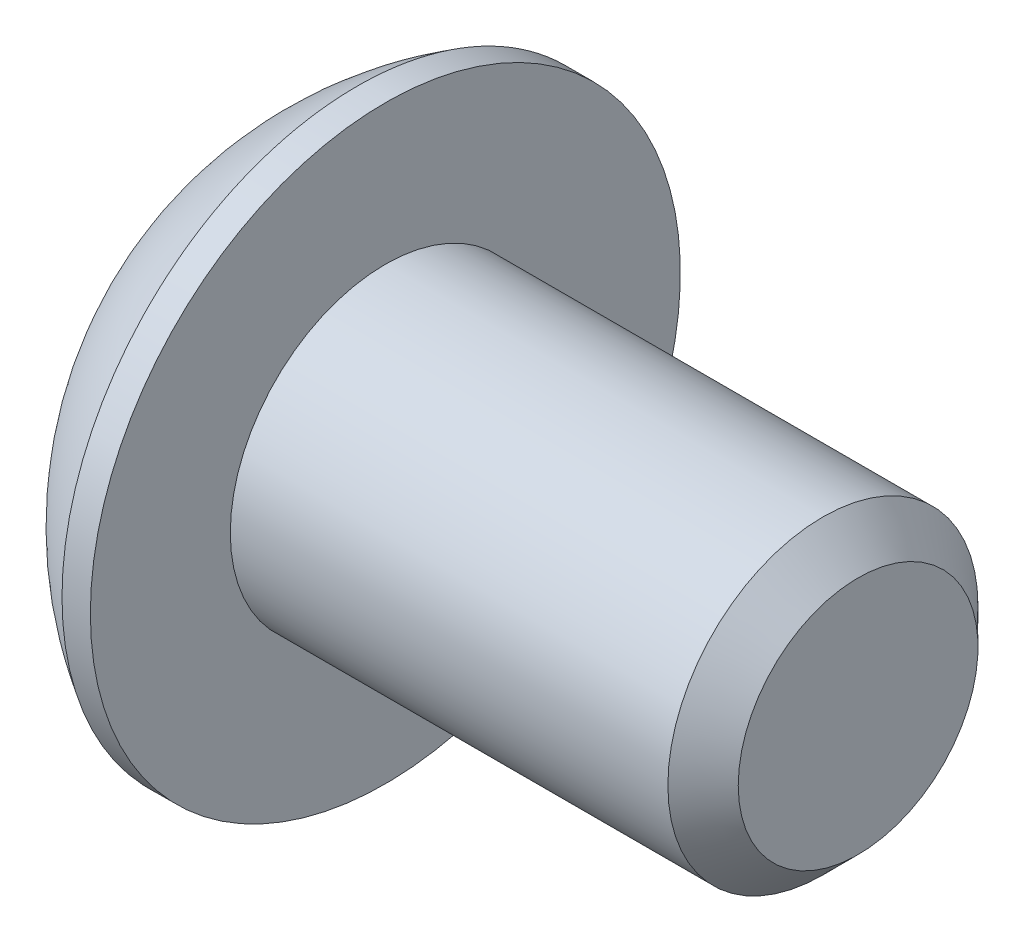
ISO-10303-21;
HEADER;
FILE_DESCRIPTION(('STEP AP214'),'2;1');
FILE_NAME('part.step','',(''),(''),'','','');
FILE_SCHEMA(('AUTOMOTIVE_DESIGN { 1 0 10303 214 1 1 1 1 }'));
ENDSEC;
DATA;
#1=APPLICATION_CONTEXT('core data for automotive mechanical design processes');
#2=APPLICATION_PROTOCOL_DEFINITION('international standard','automotive_design',2000,#1);
#3=PRODUCT_CONTEXT('',#1,'mechanical');
#4=PRODUCT('Part','Part','',(#3));
#5=PRODUCT_RELATED_PRODUCT_CATEGORY('part','',(#4));
#6=PRODUCT_DEFINITION_FORMATION('','',#4);
#7=PRODUCT_DEFINITION_CONTEXT('part definition',#1,'design');
#8=PRODUCT_DEFINITION('design','',#6,#7);
#9=PRODUCT_DEFINITION_SHAPE('','',#8);
#10=(LENGTH_UNIT() NAMED_UNIT(*) SI_UNIT(.MILLI.,.METRE.));
#11=(NAMED_UNIT(*) PLANE_ANGLE_UNIT() SI_UNIT($,.RADIAN.));
#12=(NAMED_UNIT(*) SI_UNIT($,.STERADIAN.) SOLID_ANGLE_UNIT());
#13=UNCERTAINTY_MEASURE_WITH_UNIT(LENGTH_MEASURE(1.E-05),#10,'distance_accuracy_value','');
#14=(GEOMETRIC_REPRESENTATION_CONTEXT(3) GLOBAL_UNCERTAINTY_ASSIGNED_CONTEXT((#13)) GLOBAL_UNIT_ASSIGNED_CONTEXT((#10,
#11,#12)) REPRESENTATION_CONTEXT('',''));
#15=CARTESIAN_POINT('',(0.,0.,0.));
#16=DIRECTION('',(0.,0.,1.));
#17=DIRECTION('',(1.,0.,0.));
#18=AXIS2_PLACEMENT_3D('',#15,#16,#17);
#19=CARTESIAN_POINT('',(1.32080000000034,0.,0.));
#20=DIRECTION('',(-1.,0.,0.));
#21=DIRECTION('',(0.,0.,1.));
#22=AXIS2_PLACEMENT_3D('',#19,#20,#21);
#23=CONICAL_SURFACE('',#22,1.1937999999998,1.04719755119608);
#24=CARTESIAN_POINT('',(2.01004075135902,0.,4.44089209850063E-13));
#25=VERTEX_POINT('',#24);
#26=VERTEX_LOOP('',#25);
#27=FACE_BOUND('',#26,.T.);
#28=CARTESIAN_POINT('',(1.32080000000009,0.,0.));
#29=DIRECTION('',(-1.,0.,0.));
#30=DIRECTION('',(0.,0.,1.));
#31=AXIS2_PLACEMENT_3D('',#28,#29,#30);
#32=CIRCLE('',#31,1.19380000000024);
#33=CARTESIAN_POINT('',(1.32080000000004,-1.03386112703797,0.59690000000006));
#34=VERTEX_POINT('',#33);
#35=CARTESIAN_POINT('',(1.32080000000004,0.,1.19380000000012));
#36=VERTEX_POINT('',#35);
#37=EDGE_CURVE('E18',#34,#36,#32,.T.);
#38=ORIENTED_EDGE('',*,*,#37,.T.);
#39=CARTESIAN_POINT('',(1.32080000000009,0.,0.));
#40=DIRECTION('',(-1.,0.,0.));
#41=DIRECTION('',(0.,0.,1.));
#42=AXIS2_PLACEMENT_3D('',#39,#40,#41);
#43=CIRCLE('',#42,1.19380000000024);
#44=CARTESIAN_POINT('',(1.32080000000004,1.03386112703797,0.596900000000061));
#45=VERTEX_POINT('',#44);
#46=EDGE_CURVE('E147',#36,#45,#43,.T.);
#47=ORIENTED_EDGE('',*,*,#46,.T.);
#48=CARTESIAN_POINT('',(1.32080000000009,0.,0.));
#49=DIRECTION('',(-1.,0.,0.));
#50=DIRECTION('',(0.,0.,1.));
#51=AXIS2_PLACEMENT_3D('',#48,#49,#50);
#52=CIRCLE('',#51,1.19380000000024);
#53=CARTESIAN_POINT('',(1.32080000000004,1.03386112703797,-0.596900000000061));
#54=VERTEX_POINT('',#53);
#55=EDGE_CURVE('E475',#45,#54,#52,.T.);
#56=ORIENTED_EDGE('',*,*,#55,.T.);
#57=CARTESIAN_POINT('',(1.32080000000009,0.,0.));
#58=DIRECTION('',(-1.,0.,0.));
#59=DIRECTION('',(0.,0.,1.));
#60=AXIS2_PLACEMENT_3D('',#57,#58,#59);
#61=CIRCLE('',#60,1.19380000000024);
#62=CARTESIAN_POINT('',(1.32080000000004,1.49457637585666E-12,-1.19380000000012));
#63=VERTEX_POINT('',#62);
#64=EDGE_CURVE('E476',#54,#63,#61,.T.);
#65=ORIENTED_EDGE('',*,*,#64,.T.);
#66=CARTESIAN_POINT('',(1.32080000000009,0.,0.));
#67=DIRECTION('',(-1.,0.,0.));
#68=DIRECTION('',(0.,0.,1.));
#69=AXIS2_PLACEMENT_3D('',#66,#67,#68);
#70=CIRCLE('',#69,1.19380000000024);
#71=CARTESIAN_POINT('',(1.32080000000004,-1.03386112703797,-0.59690000000006));
#72=VERTEX_POINT('',#71);
#73=EDGE_CURVE('E91',#63,#72,#70,.T.);
#74=ORIENTED_EDGE('',*,*,#73,.T.);
#75=CARTESIAN_POINT('',(1.32080000000009,0.,0.));
#76=DIRECTION('',(-1.,0.,0.));
#77=DIRECTION('',(0.,0.,1.));
#78=AXIS2_PLACEMENT_3D('',#75,#76,#77);
#79=CIRCLE('',#78,1.19380000000024);
#80=EDGE_CURVE('E87',#72,#34,#79,.T.);
#81=ORIENTED_EDGE('',*,*,#80,.T.);
#82=EDGE_LOOP('',(#38,#47,#56,#65,#74,#81));
#83=FACE_BOUND('',#82,.T.);
#84=ADVANCED_FACE('F15',(#27,#83),#23,.F.);
#85=CARTESIAN_POINT('',(1.3208,-2.06772225407572,-1.1938));
#86=DIRECTION('',(1.,0.,0.));
#87=DIRECTION('',(0.,0.,-1.));
#88=AXIS2_PLACEMENT_3D('',#85,#86,#87);
#89=PLANE('',#88);
#90=DIRECTION('',(0.,0.5,0.866025403784439));
#91=VECTOR('',#90,1.);
#92=CARTESIAN_POINT('',(1.3208,-1.37848150271715,0.));
#93=LINE('',#92,#91);
#94=CARTESIAN_POINT('',(1.3208,-0.689240751358574,1.1938));
#95=VERTEX_POINT('',#94);
#96=EDGE_CURVE('E99',#95,#34,#93,.F.);
#97=ORIENTED_EDGE('',*,*,#96,.F.);
#98=DIRECTION('',(0.,1.,0.));
#99=VECTOR('',#98,1.);
#100=CARTESIAN_POINT('',(1.3208,-0.689240751358574,1.1938));
#101=LINE('',#100,#99);
#102=EDGE_CURVE('E101',#36,#95,#101,.F.);
#103=ORIENTED_EDGE('',*,*,#102,.F.);
#104=ORIENTED_EDGE('',*,*,#37,.F.);
#105=EDGE_LOOP('',(#97,#103,#104));
#106=FACE_BOUND('',#105,.T.);
#107=ADVANCED_FACE('F97',(#106),#89,.F.);
#108=CARTESIAN_POINT('',(1.3208,-2.06772225407572,-1.1938));
#109=DIRECTION('',(1.,0.,0.));
#110=DIRECTION('',(0.,0.,-1.));
#111=AXIS2_PLACEMENT_3D('',#108,#109,#110);
#112=PLANE('',#111);
#113=DIRECTION('',(0.,-0.5,0.866025403784439));
#114=VECTOR('',#113,1.);
#115=CARTESIAN_POINT('',(1.3208,-0.689240751358574,-1.1938));
#116=LINE('',#115,#114);
#117=CARTESIAN_POINT('',(1.3208,-1.37848150271715,0.));
#118=VERTEX_POINT('',#117);
#119=EDGE_CURVE('E107',#118,#72,#116,.F.);
#120=ORIENTED_EDGE('',*,*,#119,.F.);
#121=DIRECTION('',(0.,0.5,0.866025403784439));
#122=VECTOR('',#121,1.);
#123=CARTESIAN_POINT('',(1.3208,-1.37848150271715,0.));
#124=LINE('',#123,#122);
#125=EDGE_CURVE('E104',#34,#118,#124,.F.);
#126=ORIENTED_EDGE('',*,*,#125,.F.);
#127=ORIENTED_EDGE('',*,*,#80,.F.);
#128=EDGE_LOOP('',(#120,#126,#127));
#129=FACE_BOUND('',#128,.T.);
#130=ADVANCED_FACE('F105',(#129),#112,.F.);
#131=CARTESIAN_POINT('',(1.3208,-2.06772225407572,-1.1938));
#132=DIRECTION('',(1.,0.,0.));
#133=DIRECTION('',(0.,0.,-1.));
#134=AXIS2_PLACEMENT_3D('',#131,#132,#133);
#135=PLANE('',#134);
#136=DIRECTION('',(0.,1.,0.));
#137=VECTOR('',#136,1.);
#138=CARTESIAN_POINT('',(1.3208,0.689240751358577,-1.1938));
#139=LINE('',#138,#137);
#140=CARTESIAN_POINT('',(1.3208,-0.689240751358574,-1.1938));
#141=VERTEX_POINT('',#140);
#142=EDGE_CURVE('E446',#141,#63,#139,.T.);
#143=ORIENTED_EDGE('',*,*,#142,.F.);
#144=DIRECTION('',(0.,-0.5,0.866025403784439));
#145=VECTOR('',#144,1.);
#146=CARTESIAN_POINT('',(1.3208,-0.689240751358574,-1.1938));
#147=LINE('',#146,#145);
#148=EDGE_CURVE('E458',#72,#141,#147,.F.);
#149=ORIENTED_EDGE('',*,*,#148,.F.);
#150=ORIENTED_EDGE('',*,*,#73,.F.);
#151=EDGE_LOOP('',(#143,#149,#150));
#152=FACE_BOUND('',#151,.T.);
#153=ADVANCED_FACE('F190',(#152),#135,.F.);
#154=CARTESIAN_POINT('',(1.3208,-2.06772225407572,-1.1938));
#155=DIRECTION('',(1.,0.,0.));
#156=DIRECTION('',(0.,0.,-1.));
#157=AXIS2_PLACEMENT_3D('',#154,#155,#156);
#158=PLANE('',#157);
#159=DIRECTION('',(0.,-0.5,-0.866025403784439));
#160=VECTOR('',#159,1.);
#161=CARTESIAN_POINT('',(1.3208,1.37848150271715,0.));
#162=LINE('',#161,#160);
#163=CARTESIAN_POINT('',(1.3208,0.689240751358577,-1.1938));
#164=VERTEX_POINT('',#163);
#165=EDGE_CURVE('E432',#164,#54,#162,.F.);
#166=ORIENTED_EDGE('',*,*,#165,.F.);
#167=DIRECTION('',(0.,1.,0.));
#168=VECTOR('',#167,1.);
#169=CARTESIAN_POINT('',(1.3208,0.689240751358577,-1.1938));
#170=LINE('',#169,#168);
#171=EDGE_CURVE('E443',#63,#164,#170,.T.);
#172=ORIENTED_EDGE('',*,*,#171,.F.);
#173=ORIENTED_EDGE('',*,*,#64,.F.);
#174=EDGE_LOOP('',(#166,#172,#173));
#175=FACE_BOUND('',#174,.T.);
#176=ADVANCED_FACE('F186',(#175),#158,.F.);
#177=CARTESIAN_POINT('',(1.3208,-2.06772225407572,-1.1938));
#178=DIRECTION('',(1.,0.,0.));
#179=DIRECTION('',(0.,0.,-1.));
#180=AXIS2_PLACEMENT_3D('',#177,#178,#179);
#181=PLANE('',#180);
#182=DIRECTION('',(0.,0.5,-0.866025403784439));
#183=VECTOR('',#182,1.);
#184=CARTESIAN_POINT('',(1.3208,0.689240751358576,1.1938));
#185=LINE('',#184,#183);
#186=CARTESIAN_POINT('',(1.3208,1.37848150271715,0.));
#187=VERTEX_POINT('',#186);
#188=EDGE_CURVE('E411',#187,#45,#185,.F.);
#189=ORIENTED_EDGE('',*,*,#188,.F.);
#190=DIRECTION('',(0.,-0.5,-0.866025403784439));
#191=VECTOR('',#190,1.);
#192=CARTESIAN_POINT('',(1.3208,1.37848150271715,0.));
#193=LINE('',#192,#191);
#194=EDGE_CURVE('E430',#54,#187,#193,.F.);
#195=ORIENTED_EDGE('',*,*,#194,.F.);
#196=ORIENTED_EDGE('',*,*,#55,.F.);
#197=EDGE_LOOP('',(#189,#195,#196));
#198=FACE_BOUND('',#197,.T.);
#199=ADVANCED_FACE('F182',(#198),#181,.F.);
#200=CARTESIAN_POINT('',(1.3208,-2.06772225407572,-1.1938));
#201=DIRECTION('',(1.,0.,0.));
#202=DIRECTION('',(0.,0.,-1.));
#203=AXIS2_PLACEMENT_3D('',#200,#201,#202);
#204=PLANE('',#203);
#205=DIRECTION('',(0.,1.,0.));
#206=VECTOR('',#205,1.);
#207=CARTESIAN_POINT('',(1.3208,-0.689240751358574,1.1938));
#208=LINE('',#207,#206);
#209=CARTESIAN_POINT('',(1.3208,0.689240751358576,1.1938));
#210=VERTEX_POINT('',#209);
#211=EDGE_CURVE('E116',#210,#36,#208,.F.);
#212=ORIENTED_EDGE('',*,*,#211,.F.);
#213=DIRECTION('',(0.,0.5,-0.866025403784439));
#214=VECTOR('',#213,1.);
#215=CARTESIAN_POINT('',(1.3208,0.689240751358576,1.1938));
#216=LINE('',#215,#214);
#217=EDGE_CURVE('E414',#45,#210,#216,.F.);
#218=ORIENTED_EDGE('',*,*,#217,.F.);
#219=ORIENTED_EDGE('',*,*,#46,.F.);
#220=EDGE_LOOP('',(#212,#218,#219));
#221=FACE_BOUND('',#220,.T.);
#222=ADVANCED_FACE('F178',(#221),#204,.F.);
#223=CARTESIAN_POINT('',(1.3208,-0.689240751358574,1.1938));
#224=DIRECTION('',(0.,0.,-1.));
#225=DIRECTION('',(0.,1.,0.));
#226=AXIS2_PLACEMENT_3D('',#223,#224,#225);
#227=PLANE('',#226);
#228=DIRECTION('',(0.,1.,0.));
#229=VECTOR('',#228,1.);
#230=CARTESIAN_POINT('',(0.,0.,1.1938));
#231=LINE('',#230,#229);
#232=CARTESIAN_POINT('',(0.,0.689240751358577,1.1938));
#233=VERTEX_POINT('',#232);
#234=CARTESIAN_POINT('',(0.,-0.689240751358574,1.1938));
#235=VERTEX_POINT('',#234);
#236=EDGE_CURVE('E408',#233,#235,#231,.F.);
#237=ORIENTED_EDGE('',*,*,#236,.F.);
#238=DIRECTION('',(1.,0.,0.));
#239=VECTOR('',#238,1.);
#240=CARTESIAN_POINT('',(1.3208,0.689240751358576,1.1938));
#241=LINE('',#240,#239);
#242=EDGE_CURVE('E420',#210,#233,#241,.F.);
#243=ORIENTED_EDGE('',*,*,#242,.F.);
#244=ORIENTED_EDGE('',*,*,#211,.T.);
#245=ORIENTED_EDGE('',*,*,#102,.T.);
#246=DIRECTION('',(1.,0.,0.));
#247=VECTOR('',#246,1.);
#248=CARTESIAN_POINT('',(1.3208,-0.689240751358574,1.1938));
#249=LINE('',#248,#247);
#250=EDGE_CURVE('E110',#235,#95,#249,.T.);
#251=ORIENTED_EDGE('',*,*,#250,.F.);
#252=EDGE_LOOP('',(#237,#243,#244,#245,#251));
#253=FACE_BOUND('',#252,.T.);
#254=ADVANCED_FACE('F175',(#253),#227,.T.);
#255=CARTESIAN_POINT('',(1.3208,-1.37848150271715,0.));
#256=DIRECTION('',(0.,0.866025403784439,-0.5));
#257=DIRECTION('',(0.,0.5,0.866025403784439));
#258=AXIS2_PLACEMENT_3D('',#255,#256,#257);
#259=PLANE('',#258);
#260=DIRECTION('',(0.,-0.5,-0.866025403784439));
#261=VECTOR('',#260,1.);
#262=CARTESIAN_POINT('',(0.,-0.689240751358574,1.1938));
#263=LINE('',#262,#261);
#264=CARTESIAN_POINT('',(0.,-1.37848150271715,0.));
#265=VERTEX_POINT('',#264);
#266=EDGE_CURVE('E405',#235,#265,#263,.T.);
#267=ORIENTED_EDGE('',*,*,#266,.F.);
#268=ORIENTED_EDGE('',*,*,#250,.T.);
#269=ORIENTED_EDGE('',*,*,#96,.T.);
#270=ORIENTED_EDGE('',*,*,#125,.T.);
#271=DIRECTION('',(1.,0.,0.));
#272=VECTOR('',#271,1.);
#273=CARTESIAN_POINT('',(1.3208,-1.37848150271715,0.));
#274=LINE('',#273,#272);
#275=EDGE_CURVE('E455',#265,#118,#274,.T.);
#276=ORIENTED_EDGE('',*,*,#275,.F.);
#277=EDGE_LOOP('',(#267,#268,#269,#270,#276));
#278=FACE_BOUND('',#277,.T.);
#279=ADVANCED_FACE('F114',(#278),#259,.T.);
#280=CARTESIAN_POINT('',(1.3208,-0.689240751358574,-1.1938));
#281=DIRECTION('',(0.,0.866025403784439,0.5));
#282=DIRECTION('',(0.,-0.5,0.866025403784439));
#283=AXIS2_PLACEMENT_3D('',#280,#281,#282);
#284=PLANE('',#283);
#285=DIRECTION('',(0.,0.5,-0.866025403784439));
#286=VECTOR('',#285,1.);
#287=CARTESIAN_POINT('',(0.,-1.37848150271715,0.));
#288=LINE('',#287,#286);
#289=CARTESIAN_POINT('',(0.,-0.689240751358574,-1.1938));
#290=VERTEX_POINT('',#289);
#291=EDGE_CURVE('E402',#265,#290,#288,.T.);
#292=ORIENTED_EDGE('',*,*,#291,.F.);
#293=ORIENTED_EDGE('',*,*,#275,.T.);
#294=ORIENTED_EDGE('',*,*,#119,.T.);
#295=ORIENTED_EDGE('',*,*,#148,.T.);
#296=DIRECTION('',(1.,0.,0.));
#297=VECTOR('',#296,1.);
#298=CARTESIAN_POINT('',(1.3208,-0.689240751358574,-1.1938));
#299=LINE('',#298,#297);
#300=EDGE_CURVE('E440',#290,#141,#299,.T.);
#301=ORIENTED_EDGE('',*,*,#300,.F.);
#302=EDGE_LOOP('',(#292,#293,#294,#295,#301));
#303=FACE_BOUND('',#302,.T.);
#304=ADVANCED_FACE('F168',(#303),#284,.T.);
#305=CARTESIAN_POINT('',(1.3208,0.689240751358577,-1.1938));
#306=DIRECTION('',(0.,0.,1.));
#307=DIRECTION('',(1.,0.,0.));
#308=AXIS2_PLACEMENT_3D('',#305,#306,#307);
#309=PLANE('',#308);
#310=DIRECTION('',(0.,1.,0.));
#311=VECTOR('',#310,1.);
#312=CARTESIAN_POINT('',(0.,0.,-1.1938));
#313=LINE('',#312,#311);
#314=CARTESIAN_POINT('',(0.,0.689240751358577,-1.1938));
#315=VERTEX_POINT('',#314);
#316=EDGE_CURVE('E399',#290,#315,#313,.T.);
#317=ORIENTED_EDGE('',*,*,#316,.F.);
#318=ORIENTED_EDGE('',*,*,#300,.T.);
#319=ORIENTED_EDGE('',*,*,#142,.T.);
#320=ORIENTED_EDGE('',*,*,#171,.T.);
#321=DIRECTION('',(1.,0.,0.));
#322=VECTOR('',#321,1.);
#323=CARTESIAN_POINT('',(1.3208,0.689240751358577,-1.1938));
#324=LINE('',#323,#322);
#325=EDGE_CURVE('E415',#315,#164,#324,.T.);
#326=ORIENTED_EDGE('',*,*,#325,.F.);
#327=EDGE_LOOP('',(#317,#318,#319,#320,#326));
#328=FACE_BOUND('',#327,.T.);
#329=ADVANCED_FACE('F165',(#328),#309,.T.);
#330=CARTESIAN_POINT('',(1.3208,1.37848150271715,0.));
#331=DIRECTION('',(0.,-0.866025403784439,0.5));
#332=DIRECTION('',(0.,-0.5,-0.866025403784439));
#333=AXIS2_PLACEMENT_3D('',#330,#331,#332);
#334=PLANE('',#333);
#335=DIRECTION('',(0.,0.5,0.866025403784439));
#336=VECTOR('',#335,1.);
#337=CARTESIAN_POINT('',(0.,0.689240751358577,-1.1938));
#338=LINE('',#337,#336);
#339=CARTESIAN_POINT('',(0.,1.37848150271715,0.));
#340=VERTEX_POINT('',#339);
#341=EDGE_CURVE('E396',#315,#340,#338,.T.);
#342=ORIENTED_EDGE('',*,*,#341,.F.);
#343=ORIENTED_EDGE('',*,*,#325,.T.);
#344=ORIENTED_EDGE('',*,*,#165,.T.);
#345=ORIENTED_EDGE('',*,*,#194,.T.);
#346=DIRECTION('',(1.,0.,0.));
#347=VECTOR('',#346,1.);
#348=CARTESIAN_POINT('',(1.3208,1.37848150271715,0.));
#349=LINE('',#348,#347);
#350=EDGE_CURVE('E33',#340,#187,#349,.T.);
#351=ORIENTED_EDGE('',*,*,#350,.F.);
#352=EDGE_LOOP('',(#342,#343,#344,#345,#351));
#353=FACE_BOUND('',#352,.T.);
#354=ADVANCED_FACE('F161',(#353),#334,.T.);
#355=CARTESIAN_POINT('',(1.3208,0.689240751358576,1.1938));
#356=DIRECTION('',(0.,-0.866025403784439,-0.5));
#357=DIRECTION('',(0.,0.5,-0.866025403784439));
#358=AXIS2_PLACEMENT_3D('',#355,#356,#357);
#359=PLANE('',#358);
#360=DIRECTION('',(0.,-0.5,0.866025403784439));
#361=VECTOR('',#360,1.);
#362=CARTESIAN_POINT('',(0.,1.37848150271715,0.));
#363=LINE('',#362,#361);
#364=EDGE_CURVE('E146',#340,#233,#363,.T.);
#365=ORIENTED_EDGE('',*,*,#364,.F.);
#366=ORIENTED_EDGE('',*,*,#350,.T.);
#367=ORIENTED_EDGE('',*,*,#188,.T.);
#368=ORIENTED_EDGE('',*,*,#217,.T.);
#369=ORIENTED_EDGE('',*,*,#242,.T.);
#370=EDGE_LOOP('',(#365,#366,#367,#368,#369));
#371=FACE_BOUND('',#370,.T.);
#372=ADVANCED_FACE('F157',(#371),#359,.T.);
#373=CARTESIAN_POINT('',(0.,0.,0.));
#374=DIRECTION('',(-1.,0.,0.));
#375=DIRECTION('',(0.,0.,1.));
#376=AXIS2_PLACEMENT_3D('',#373,#374,#375);
#377=PLANE('',#376);
#378=ORIENTED_EDGE('',*,*,#341,.T.);
#379=ORIENTED_EDGE('',*,*,#364,.T.);
#380=ORIENTED_EDGE('',*,*,#236,.T.);
#381=ORIENTED_EDGE('',*,*,#266,.T.);
#382=ORIENTED_EDGE('',*,*,#291,.T.);
#383=ORIENTED_EDGE('',*,*,#316,.T.);
#384=EDGE_LOOP('',(#378,#379,#380,#381,#382,#383));
#385=FACE_BOUND('',#384,.T.);
#386=CARTESIAN_POINT('',(0.,1.9812,0.));
#387=CARTESIAN_POINT('',(0.,1.9811996664299,0.0556258831179428));
#388=CARTESIAN_POINT('',(0.,1.97885520380442,0.111261989398606));
#389=CARTESIAN_POINT('',(0.,1.96949260169541,0.222149719830458));
#390=CARTESIAN_POINT('',(0.,1.96247308239605,0.277401225602895));
#391=CARTESIAN_POINT('',(0.,1.94379192841038,0.387209508139747));
#392=CARTESIAN_POINT('',(-1.85325793235264E-13,1.93212292489526,0.441765039546365));
#393=CARTESIAN_POINT('',(1.86344214223505E-13,1.90422331175315,0.549729449347493));
#394=CARTESIAN_POINT('',(6.94543371897454E-13,1.88798900035338,0.603137359208869));
#395=CARTESIAN_POINT('',(1.15501975216981E-12,1.83266214476501,0.760839131321828));
#396=CARTESIAN_POINT('',(0.,1.78690023648845,0.862876433575429));
#397=CARTESIAN_POINT('',(0.,1.67887358150667,1.05780719540872));
#398=CARTESIAN_POINT('',(9.54193214892627E-13,1.6166082074585,1.15070030720801));
#399=CARTESIAN_POINT('',(5.94805591894675E-13,1.51224157140982,1.28116890915697));
#400=CARTESIAN_POINT('',(1.63221293851378E-13,1.4755970394354,1.32320451127026));
#401=CARTESIAN_POINT('',(-1.62196980336157E-13,1.39893832619713,1.40400288695709));
#402=CARTESIAN_POINT('',(0.,1.35892742784698,1.44276877695455));
#403=CARTESIAN_POINT('',(1.14362537325405E-13,1.23416504602197,1.55382272417904));
#404=CARTESIAN_POINT('',(0.,1.14466125559859,1.62089527952111));
#405=CARTESIAN_POINT('',(0.,0.955712144178167,1.7390221808118));
#406=CARTESIAN_POINT('',(0.,0.856267198233564,1.79007713076007));
#407=CARTESIAN_POINT('',(0.,0.650206345910843,1.87477637530954));
#408=CARTESIAN_POINT('',(0.,0.543590516134855,1.90842085586267));
#409=CARTESIAN_POINT('',(0.,0.326226155292018,1.95733039300656));
#410=CARTESIAN_POINT('',(0.,0.21547760215793,1.97259535144288));
#411=CARTESIAN_POINT('',(0.,-0.00701040587544639,1.98431697865418));
#412=CARTESIAN_POINT('',(0.,-0.118749860774734,1.98077364742917));
#413=CARTESIAN_POINT('',(0.,-0.340050178355485,1.95497485623825));
#414=CARTESIAN_POINT('',(0.,-0.449611052668255,1.93271949620218));
#415=CARTESIAN_POINT('',(0.,-0.663431110729174,1.87014138774523));
#416=CARTESIAN_POINT('',(0.,-0.76769023783852,1.82981844635272));
#417=CARTESIAN_POINT('',(0.,-0.968005760719347,1.73219968377096));
#418=CARTESIAN_POINT('',(0.,-1.0640618469811,1.6749032225164));
#419=CARTESIAN_POINT('',(0.,-1.19980276751283,1.57757371205873));
#420=CARTESIAN_POINT('',(0.,-1.24366557129213,1.54322665019466));
#421=CARTESIAN_POINT('',(0.,-1.32838995706696,1.47093063174264));
#422=CARTESIAN_POINT('',(0.,-1.36924860178706,1.43297823102439));
#423=CARTESIAN_POINT('',(0.,-1.48674671849223,1.31419842051173));
#424=CARTESIAN_POINT('',(0.,-1.55842832343237,1.22836221289311));
#425=CARTESIAN_POINT('',(0.,-1.6863396856475,1.04586168272493));
#426=CARTESIAN_POINT('',(0.,-1.7425700302488,0.949197771949774));
#427=CARTESIAN_POINT('',(0.,-1.8141614250401,0.798182600298684));
#428=CARTESIAN_POINT('',(0.,-1.83591780585875,0.746776203847791));
#429=CARTESIAN_POINT('',(0.,-1.87500754181092,0.642341081688636));
#430=CARTESIAN_POINT('',(0.,-1.89234447645404,0.589313708122847));
#431=CARTESIAN_POINT('',(0.,-1.92246053433554,0.482076273028395));
#432=CARTESIAN_POINT('',(0.,-1.93524685475118,0.42786822425751));
#433=CARTESIAN_POINT('',(0.,-1.95620937250494,0.318578151844611));
#434=CARTESIAN_POINT('',(0.,-1.96438692958147,0.263496390912872));
#435=CARTESIAN_POINT('',(0.,-1.97388528284653,0.173607715038558));
#436=CARTESIAN_POINT('',(0.,-1.97662743364426,0.138944718024998));
#437=CARTESIAN_POINT('',(0.,-1.98028489645283,0.0695224782567002));
#438=CARTESIAN_POINT('',(0.,-1.98120020846367,0.0347632355019631));
#439=CARTESIAN_POINT('',(0.,-1.9811996664299,-0.0556258831179437));
#440=CARTESIAN_POINT('',(0.,-1.97885520380442,-0.111261989398607));
#441=CARTESIAN_POINT('',(0.,-1.96949260169541,-0.222149719830459));
#442=CARTESIAN_POINT('',(0.,-1.96247308239605,-0.277401225602897));
#443=CARTESIAN_POINT('',(0.,-1.94379192841039,-0.387209508139749));
#444=CARTESIAN_POINT('',(-1.85269749640691E-13,-1.93212292489526,-0.441765039546367));
#445=CARTESIAN_POINT('',(1.86288125054388E-13,-1.90422331175315,-0.549729449347495));
#446=CARTESIAN_POINT('',(6.94525090263764E-13,-1.88798900035338,-0.603137359208872));
#447=CARTESIAN_POINT('',(1.15505622829081E-12,-1.83266214476501,-0.760839131321831));
#448=CARTESIAN_POINT('',(0.,-1.78690023648845,-0.862876433575431));
#449=CARTESIAN_POINT('',(0.,-1.67887358150667,-1.05780719540872));
#450=CARTESIAN_POINT('',(9.54248812869379E-13,-1.6166082074585,-1.15070030720801));
#451=CARTESIAN_POINT('',(5.94777756479239E-13,-1.51224157140982,-1.28116890915698));
#452=CARTESIAN_POINT('',(1.63138949183833E-13,-1.47559703943539,-1.32320451127027));
#453=CARTESIAN_POINT('',(-1.62114715061273E-13,-1.39893832619713,-1.40400288695709));
#454=CARTESIAN_POINT('',(0.,-1.35892742784699,-1.44276877695455));
#455=CARTESIAN_POINT('',(1.13760489124207E-13,-1.23416504602197,-1.55382272417904));
#456=CARTESIAN_POINT('',(0.,-1.14466125559859,-1.62089527952111));
#457=CARTESIAN_POINT('',(0.,-0.95571214417816,-1.73902218081179));
#458=CARTESIAN_POINT('',(0.,-0.856267198233559,-1.79007713076007));
#459=CARTESIAN_POINT('',(0.,-0.650206345910841,-1.87477637530954));
#460=CARTESIAN_POINT('',(0.,-0.543590516134854,-1.90842085586267));
#461=CARTESIAN_POINT('',(0.,-0.326226155292018,-1.95733039300657));
#462=CARTESIAN_POINT('',(0.,-0.215477602157929,-1.97259535144288));
#463=CARTESIAN_POINT('',(0.,0.0070104058754487,-1.98431697865418));
#464=CARTESIAN_POINT('',(0.,0.118749860774737,-1.98077364742916));
#465=CARTESIAN_POINT('',(0.,0.340050178355489,-1.95497485623824));
#466=CARTESIAN_POINT('',(0.,0.44961105266826,-1.93271949620218));
#467=CARTESIAN_POINT('',(0.,0.663431110729178,-1.87014138774524));
#468=CARTESIAN_POINT('',(0.,0.767690237838524,-1.82981844635272));
#469=CARTESIAN_POINT('',(0.,0.968005760719348,-1.73219968377096));
#470=CARTESIAN_POINT('',(0.,1.0640618469811,-1.67490322251639));
#471=CARTESIAN_POINT('',(0.,1.19980276751283,-1.57757371205873));
#472=CARTESIAN_POINT('',(0.,1.24366557129214,-1.54322665019465));
#473=CARTESIAN_POINT('',(0.,1.32838995706696,-1.47093063174263));
#474=CARTESIAN_POINT('',(0.,1.36924860178706,-1.43297823102439));
#475=CARTESIAN_POINT('',(0.,1.48674671849223,-1.31419842051172));
#476=CARTESIAN_POINT('',(0.,1.55842832343237,-1.22836221289311));
#477=CARTESIAN_POINT('',(0.,1.6863396856475,-1.04586168272492));
#478=CARTESIAN_POINT('',(0.,1.7425700302488,-0.949197771949768));
#479=CARTESIAN_POINT('',(0.,1.8141614250401,-0.798182600298677));
#480=CARTESIAN_POINT('',(0.,1.83591780585875,-0.746776203847785));
#481=CARTESIAN_POINT('',(0.,1.87500754181092,-0.64234108168863));
#482=CARTESIAN_POINT('',(0.,1.89234447645404,-0.589313708122841));
#483=CARTESIAN_POINT('',(0.,1.92246053433555,-0.482076273028389));
#484=CARTESIAN_POINT('',(0.,1.93524685475118,-0.427868224257505));
#485=CARTESIAN_POINT('',(0.,1.95620937250494,-0.318578151844605));
#486=CARTESIAN_POINT('',(0.,1.96438692958147,-0.263496390912866));
#487=CARTESIAN_POINT('',(0.,1.97388528284653,-0.173607715038553));
#488=CARTESIAN_POINT('',(0.,1.97662743364426,-0.138944718024994));
#489=CARTESIAN_POINT('',(0.,1.98028489645283,-0.0695224782566989));
#490=CARTESIAN_POINT('',(0.,1.98120020846367,-0.034763235501963));
#491=CARTESIAN_POINT('',(0.,1.9812,0.));
#492=B_SPLINE_CURVE_WITH_KNOTS('',3,(#386,#387,#388,#389,#390,#391,#392,#393,#394,#395,#396,
#397,#398,#399,#400,#401,#402,#403,#404,#405,#406,#407,#408,#409,#410,#411,#412,#413,#414,#415,
#416,#417,#418,#419,#420,#421,#422,#423,#424,#425,#426,#427,#428,#429,#430,#431,#432,#433,#434,
#435,#436,#437,#438,#439,#440,#441,#442,#443,#444,#445,#446,#447,#448,#449,#450,#451,#452,#453,
#454,#455,#456,#457,#458,#459,#460,#461,#462,#463,#464,#465,#466,#467,#468,#469,#470,#471,#472,
#473,#474,#475,#476,#477,#478,#479,#480,#481,#482,#483,#484,#485,#486,#487,#488,#489,#490,#491),
.UNSPECIFIED.,.T.,.F.,(4,2,2,2,2,2,2,2,2,2,2,2,2,2,2,2,2,2,2,2,2,2,2,2,2,2,2,2,2,2,2,2,2,2,2,2,
2,2,2,2,2,2,2,2,2,2,2,2,2,2,2,2,4),(0.,0.166845646007828,0.333740557374255,0.500901034367693,
0.668197445942386,1.00199278686282,1.33580081809885,1.50292354032982,1.6698851310853,
2.00370118900129,2.33750465770544,2.67130456115909,3.005106247238,3.33890793331696,
3.67270783677065,4.00651130547476,4.34032736339026,4.50728895414554,4.67441167637632,
5.00821970761259,5.34201504853332,5.50931146010827,5.67647193710191,5.84336684846844,
6.0102124944764,6.11448220058334,6.21875190669029,6.38559755269812,6.55249246406454,
6.71965294105798,6.88694935263268,7.22074469355311,7.55455272478915,7.72167544702011,
7.88863703777559,8.22245309569158,8.55625656439573,8.89005646784938,9.2238581539283,
9.55765984000725,9.89145974346094,10.2252632121651,10.5590792700806,10.7260408608358,
10.8931635830666,11.2269716143029,11.5607669552236,11.7280633667986,11.8952238437922,
12.0621187551587,12.2289644011667,12.3332341072736,12.4375038133806),.UNSPECIFIED.);
#493=CARTESIAN_POINT('',(0.,1.9812,0.));
#494=VERTEX_POINT('',#493);
#495=EDGE_CURVE('E138',#494,#494,#492,.T.);
#496=ORIENTED_EDGE('',*,*,#495,.F.);
#497=EDGE_LOOP('',(#496));
#498=FACE_BOUND('',#497,.T.);
#499=ADVANCED_FACE('F153',(#385,#498),#377,.T.);
#500=CARTESIAN_POINT('',(4.13385,0.,0.));
#501=DIRECTION('',(0.,1.,0.));
#502=DIRECTION('',(1.,0.,0.));
#503=AXIS2_PLACEMENT_3D('',#500,#501,#502);
#504=SPHERICAL_SURFACE('',#503,4.58408870578439);
#505=CARTESIAN_POINT('',(1.8288,0.,0.));
#506=DIRECTION('',(-1.,0.,0.));
#507=DIRECTION('',(0.,0.,1.));
#508=AXIS2_PLACEMENT_3D('',#505,#506,#507);
#509=CIRCLE('',#508,3.9624);
#510=CARTESIAN_POINT('',(1.8288,0.,3.9624));
#511=VERTEX_POINT('',#510);
#512=EDGE_CURVE('E135',#511,#511,#509,.F.);
#513=ORIENTED_EDGE('',*,*,#512,.F.);
#514=EDGE_LOOP('',(#513));
#515=FACE_BOUND('',#514,.T.);
#516=ORIENTED_EDGE('',*,*,#495,.T.);
#517=EDGE_LOOP('',(#516));
#518=FACE_BOUND('',#517,.T.);
#519=ADVANCED_FACE('F149',(#515,#518),#504,.T.);
#520=CARTESIAN_POINT('',(8.5598,0.,0.));
#521=DIRECTION('',(-1.,0.,0.));
#522=DIRECTION('',(0.,0.,1.));
#523=AXIS2_PLACEMENT_3D('',#520,#521,#522);
#524=PLANE('',#523);
#525=CARTESIAN_POINT('',(8.55979999994361,0.,0.));
#526=DIRECTION('',(-1.,0.,0.));
#527=DIRECTION('',(0.,0.,1.));
#528=AXIS2_PLACEMENT_3D('',#525,#526,#527);
#529=CIRCLE('',#528,1.61036000002923);
#530=CARTESIAN_POINT('',(8.55979999994361,0.,1.61036000002923));
#531=VERTEX_POINT('',#530);
#532=EDGE_CURVE('E132',#531,#531,#529,.T.);
#533=ORIENTED_EDGE('',*,*,#532,.F.);
#534=EDGE_LOOP('',(#533));
#535=FACE_BOUND('',#534,.T.);
#536=ADVANCED_FACE('F220',(#535),#524,.F.);
#537=CARTESIAN_POINT('',(0.,0.,0.));
#538=DIRECTION('',(-1.,0.,0.));
#539=DIRECTION('',(0.,0.,1.));
#540=AXIS2_PLACEMENT_3D('',#537,#538,#539);
#541=CYLINDRICAL_SURFACE('',#540,3.9624);
#542=ORIENTED_EDGE('',*,*,#512,.T.);
#543=EDGE_LOOP('',(#542));
#544=FACE_BOUND('',#543,.T.);
#545=CARTESIAN_POINT('',(2.2098,0.,0.));
#546=DIRECTION('',(-1.,0.,0.));
#547=DIRECTION('',(0.,0.,1.));
#548=AXIS2_PLACEMENT_3D('',#545,#546,#547);
#549=CIRCLE('',#548,3.9624);
#550=CARTESIAN_POINT('',(2.2098,0.,3.9624));
#551=VERTEX_POINT('',#550);
#552=EDGE_CURVE('E129',#551,#551,#549,.T.);
#553=ORIENTED_EDGE('',*,*,#552,.T.);
#554=EDGE_LOOP('',(#553));
#555=FACE_BOUND('',#554,.T.);
#556=ADVANCED_FACE('F217',(#544,#555),#541,.T.);
#557=CARTESIAN_POINT('',(8.0873599999336,0.,0.));
#558=DIRECTION('',(-1.,0.,0.));
#559=DIRECTION('',(0.,0.,1.));
#560=AXIS2_PLACEMENT_3D('',#557,#558,#559);
#561=CONICAL_SURFACE('',#560,2.08280000003924,0.785398163397448);
#562=CARTESIAN_POINT('',(8.08736,0.,0.));
#563=DIRECTION('',(-1.,0.,0.));
#564=DIRECTION('',(0.,0.,1.));
#565=AXIS2_PLACEMENT_3D('',#562,#563,#564);
#566=CIRCLE('',#565,2.0828);
#567=CARTESIAN_POINT('',(8.08736,0.,2.0828));
#568=VERTEX_POINT('',#567);
#569=EDGE_CURVE('E24',#568,#568,#566,.T.);
#570=ORIENTED_EDGE('',*,*,#569,.F.);
#571=EDGE_LOOP('',(#570));
#572=FACE_BOUND('',#571,.T.);
#573=ORIENTED_EDGE('',*,*,#532,.T.);
#574=EDGE_LOOP('',(#573));
#575=FACE_BOUND('',#574,.T.);
#576=ADVANCED_FACE('F210',(#572,#575),#561,.T.);
#577=CARTESIAN_POINT('',(2.2098,2.0828,0.));
#578=DIRECTION('',(-1.,0.,0.));
#579=DIRECTION('',(0.,0.,1.));
#580=AXIS2_PLACEMENT_3D('',#577,#578,#579);
#581=PLANE('',#580);
#582=CARTESIAN_POINT('',(2.2098,0.,0.));
#583=DIRECTION('',(-1.,0.,0.));
#584=DIRECTION('',(0.,0.,1.));
#585=AXIS2_PLACEMENT_3D('',#582,#583,#584);
#586=CIRCLE('',#585,2.0828);
#587=CARTESIAN_POINT('',(2.2098,0.,2.0828));
#588=VERTEX_POINT('',#587);
#589=EDGE_CURVE('E10',#588,#588,#586,.F.);
#590=ORIENTED_EDGE('',*,*,#589,.F.);
#591=EDGE_LOOP('',(#590));
#592=FACE_BOUND('',#591,.T.);
#593=ORIENTED_EDGE('',*,*,#552,.F.);
#594=EDGE_LOOP('',(#593));
#595=FACE_BOUND('',#594,.T.);
#596=ADVANCED_FACE('F204',(#592,#595),#581,.F.);
#597=CARTESIAN_POINT('',(0.,0.,0.));
#598=DIRECTION('',(-1.,0.,0.));
#599=DIRECTION('',(0.,0.,1.));
#600=AXIS2_PLACEMENT_3D('',#597,#598,#599);
#601=CYLINDRICAL_SURFACE('',#600,2.0828);
#602=ORIENTED_EDGE('',*,*,#589,.T.);
#603=EDGE_LOOP('',(#602));
#604=FACE_BOUND('',#603,.T.);
#605=ORIENTED_EDGE('',*,*,#569,.T.);
#606=EDGE_LOOP('',(#605));
#607=FACE_BOUND('',#606,.T.);
#608=ADVANCED_FACE('F202',(#604,#607),#601,.T.);
#609=CLOSED_SHELL('',(#84,#107,#130,#153,#176,#199,#222,#254,#279,#304,#329,#354,#372,#499,#519,
#536,#556,#576,#596,#608));
#610=MANIFOLD_SOLID_BREP('B1',#609);
#611=ADVANCED_BREP_SHAPE_REPRESENTATION('',(#18,#610),#14);
#612=SHAPE_DEFINITION_REPRESENTATION(#9,#611);
ENDSEC;
END-ISO-10303-21;
